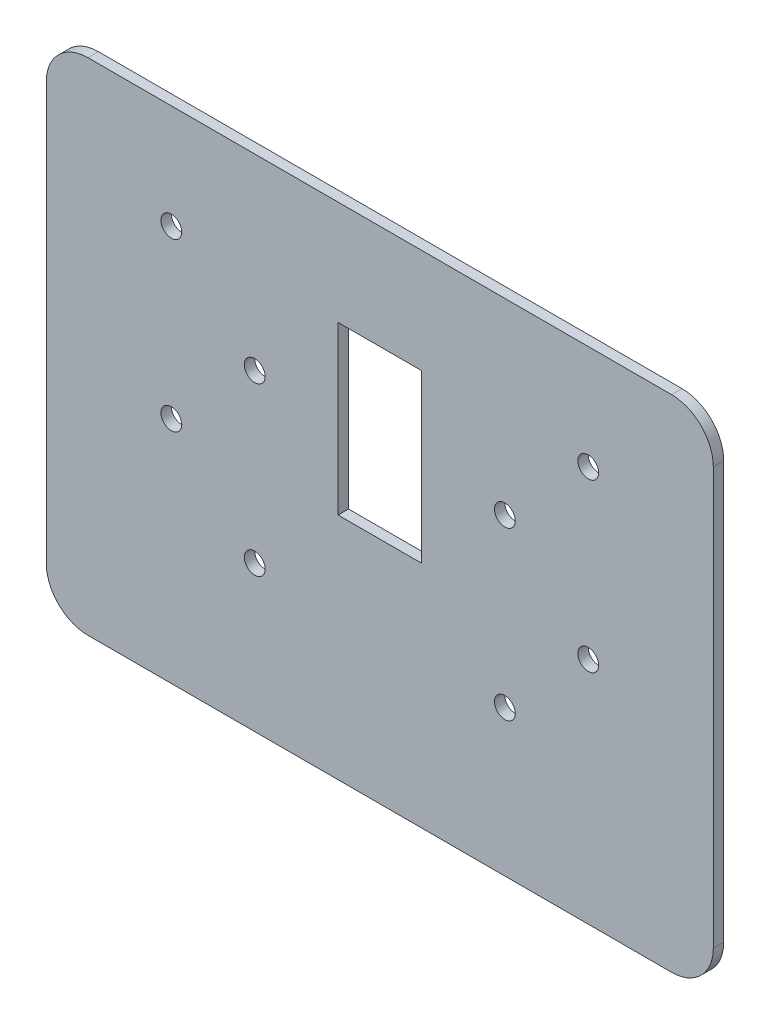
ISO-10303-21;
HEADER;
FILE_DESCRIPTION(('STEP AP214'),'2;1');
FILE_NAME('part.step','',(''),(''),'','','');
FILE_SCHEMA(('AUTOMOTIVE_DESIGN { 1 0 10303 214 1 1 1 1 }'));
ENDSEC;
DATA;
#1=APPLICATION_CONTEXT('core data for automotive mechanical design processes');
#2=APPLICATION_PROTOCOL_DEFINITION('international standard','automotive_design',2000,#1);
#3=PRODUCT_CONTEXT('',#1,'mechanical');
#4=PRODUCT('Part','Part','',(#3));
#5=PRODUCT_RELATED_PRODUCT_CATEGORY('part','',(#4));
#6=PRODUCT_DEFINITION_FORMATION('','',#4);
#7=PRODUCT_DEFINITION_CONTEXT('part definition',#1,'design');
#8=PRODUCT_DEFINITION('design','',#6,#7);
#9=PRODUCT_DEFINITION_SHAPE('','',#8);
#10=(LENGTH_UNIT() NAMED_UNIT(*) SI_UNIT(.MILLI.,.METRE.));
#11=(NAMED_UNIT(*) PLANE_ANGLE_UNIT() SI_UNIT($,.RADIAN.));
#12=(NAMED_UNIT(*) SI_UNIT($,.STERADIAN.) SOLID_ANGLE_UNIT());
#13=UNCERTAINTY_MEASURE_WITH_UNIT(LENGTH_MEASURE(1.E-05),#10,'distance_accuracy_value','');
#14=(GEOMETRIC_REPRESENTATION_CONTEXT(3) GLOBAL_UNCERTAINTY_ASSIGNED_CONTEXT((#13)) GLOBAL_UNIT_ASSIGNED_CONTEXT((#10,
#11,#12)) REPRESENTATION_CONTEXT('',''));
#15=CARTESIAN_POINT('',(0.,0.,0.));
#16=DIRECTION('',(0.,0.,1.));
#17=DIRECTION('',(1.,0.,0.));
#18=AXIS2_PLACEMENT_3D('',#15,#16,#17);
#19=CARTESIAN_POINT('',(0.,463.520831077741,3.175));
#20=DIRECTION('',(0.,1.,0.));
#21=DIRECTION('',(0.,0.,1.));
#22=AXIS2_PLACEMENT_3D('',#19,#20,#21);
#23=PLANE('',#22);
#24=DIRECTION('',(1.,0.,0.));
#25=VECTOR('',#24,1.);
#26=CARTESIAN_POINT('',(0.,463.520831077741,0.));
#27=LINE('',#26,#25);
#28=CARTESIAN_POINT('',(-392.019369125756,463.520831077741,0.));
#29=VERTEX_POINT('',#28);
#30=CARTESIAN_POINT('',(-214.219369125757,463.520831077741,0.));
#31=VERTEX_POINT('',#30);
#32=EDGE_CURVE('E194',#29,#31,#27,.T.);
#33=ORIENTED_EDGE('',*,*,#32,.F.);
#34=DIRECTION('',(0.,0.,-1.));
#35=VECTOR('',#34,1.);
#36=CARTESIAN_POINT('',(-392.019369125756,463.520831077741,3.175));
#37=LINE('',#36,#35);
#38=CARTESIAN_POINT('',(-392.019369125756,463.520831077741,3.175));
#39=VERTEX_POINT('',#38);
#40=EDGE_CURVE('E11',#39,#29,#37,.T.);
#41=ORIENTED_EDGE('',*,*,#40,.F.);
#42=DIRECTION('',(1.,0.,0.));
#43=VECTOR('',#42,1.);
#44=CARTESIAN_POINT('',(0.,463.520831077741,3.175));
#45=LINE('',#44,#43);
#46=CARTESIAN_POINT('',(-214.219369125757,463.520831077741,3.175));
#47=VERTEX_POINT('',#46);
#48=EDGE_CURVE('E276',#39,#47,#45,.T.);
#49=ORIENTED_EDGE('',*,*,#48,.T.);
#50=DIRECTION('',(0.,0.,-1.));
#51=VECTOR('',#50,1.);
#52=CARTESIAN_POINT('',(-214.219369125757,463.520831077741,3.175));
#53=LINE('',#52,#51);
#54=EDGE_CURVE('E55',#47,#31,#53,.T.);
#55=ORIENTED_EDGE('',*,*,#54,.T.);
#56=EDGE_LOOP('',(#33,#41,#49,#55));
#57=FACE_BOUND('',#56,.T.);
#58=ADVANCED_FACE('F36',(#57),#23,.T.);
#59=CARTESIAN_POINT('',(-392.019369125756,450.820831077741,3.175));
#60=DIRECTION('',(0.,0.,-1.));
#61=DIRECTION('',(-1.,0.,0.));
#62=AXIS2_PLACEMENT_3D('',#59,#60,#61);
#63=CYLINDRICAL_SURFACE('',#62,12.7);
#64=CARTESIAN_POINT('',(-392.019369125756,450.820831077741,0.));
#65=DIRECTION('',(0.,0.,1.));
#66=DIRECTION('',(1.,0.,0.));
#67=AXIS2_PLACEMENT_3D('',#64,#65,#66);
#68=CIRCLE('',#67,12.7);
#69=CARTESIAN_POINT('',(-404.719369125757,450.820831077741,0.));
#70=VERTEX_POINT('',#69);
#71=EDGE_CURVE('E196',#29,#70,#68,.T.);
#72=ORIENTED_EDGE('',*,*,#71,.T.);
#73=DIRECTION('',(0.,0.,-1.));
#74=VECTOR('',#73,1.);
#75=CARTESIAN_POINT('',(-404.719369125757,450.820831077741,3.175));
#76=LINE('',#75,#74);
#77=CARTESIAN_POINT('',(-404.719369125757,450.820831077741,3.175));
#78=VERTEX_POINT('',#77);
#79=EDGE_CURVE('E46',#78,#70,#76,.T.);
#80=ORIENTED_EDGE('',*,*,#79,.F.);
#81=CARTESIAN_POINT('',(-392.019369125756,450.820831077741,3.175));
#82=DIRECTION('',(0.,0.,1.));
#83=DIRECTION('',(1.,0.,0.));
#84=AXIS2_PLACEMENT_3D('',#81,#82,#83);
#85=CIRCLE('',#84,12.7);
#86=EDGE_CURVE('E278',#39,#78,#85,.T.);
#87=ORIENTED_EDGE('',*,*,#86,.F.);
#88=ORIENTED_EDGE('',*,*,#40,.T.);
#89=EDGE_LOOP('',(#72,#80,#87,#88));
#90=FACE_BOUND('',#89,.T.);
#91=ADVANCED_FACE('F307',(#90),#63,.T.);
#92=CARTESIAN_POINT('',(-404.719369125756,-3.53802174893844E-13,3.175));
#93=DIRECTION('',(1.,0.,0.));
#94=DIRECTION('',(0.,1.,0.));
#95=AXIS2_PLACEMENT_3D('',#92,#93,#94);
#96=PLANE('',#95);
#97=DIRECTION('',(0.,-1.,0.));
#98=VECTOR('',#97,1.);
#99=CARTESIAN_POINT('',(-404.719369125756,-3.53802174893844E-13,0.));
#100=LINE('',#99,#98);
#101=CARTESIAN_POINT('',(-404.719369125756,323.820831077741,0.));
#102=VERTEX_POINT('',#101);
#103=EDGE_CURVE('E199',#70,#102,#100,.T.);
#104=ORIENTED_EDGE('',*,*,#103,.T.);
#105=DIRECTION('',(0.,0.,-1.));
#106=VECTOR('',#105,1.);
#107=CARTESIAN_POINT('',(-404.719369125756,323.820831077741,3.175));
#108=LINE('',#107,#106);
#109=CARTESIAN_POINT('',(-404.719369125756,323.820831077741,3.175));
#110=VERTEX_POINT('',#109);
#111=EDGE_CURVE('E221',#110,#102,#108,.T.);
#112=ORIENTED_EDGE('',*,*,#111,.F.);
#113=DIRECTION('',(0.,-1.,0.));
#114=VECTOR('',#113,1.);
#115=CARTESIAN_POINT('',(-404.719369125756,-3.53802174893844E-13,3.175));
#116=LINE('',#115,#114);
#117=EDGE_CURVE('E281',#78,#110,#116,.T.);
#118=ORIENTED_EDGE('',*,*,#117,.F.);
#119=ORIENTED_EDGE('',*,*,#79,.T.);
#120=EDGE_LOOP('',(#104,#112,#118,#119));
#121=FACE_BOUND('',#120,.T.);
#122=ADVANCED_FACE('F312',(#121),#96,.F.);
#123=CARTESIAN_POINT('',(-392.019369125756,323.820831077741,3.175));
#124=DIRECTION('',(0.,0.,-1.));
#125=DIRECTION('',(-1.,0.,0.));
#126=AXIS2_PLACEMENT_3D('',#123,#124,#125);
#127=CYLINDRICAL_SURFACE('',#126,12.7);
#128=CARTESIAN_POINT('',(-392.019369125756,323.820831077741,0.));
#129=DIRECTION('',(0.,0.,1.));
#130=DIRECTION('',(1.,0.,0.));
#131=AXIS2_PLACEMENT_3D('',#128,#129,#130);
#132=CIRCLE('',#131,12.7);
#133=CARTESIAN_POINT('',(-392.019369125756,311.120831077741,0.));
#134=VERTEX_POINT('',#133);
#135=EDGE_CURVE('E202',#102,#134,#132,.T.);
#136=ORIENTED_EDGE('',*,*,#135,.T.);
#137=DIRECTION('',(0.,0.,-1.));
#138=VECTOR('',#137,1.);
#139=CARTESIAN_POINT('',(-392.019369125756,311.120831077741,3.175));
#140=LINE('',#139,#138);
#141=CARTESIAN_POINT('',(-392.019369125756,311.120831077741,3.175));
#142=VERTEX_POINT('',#141);
#143=EDGE_CURVE('E218',#142,#134,#140,.T.);
#144=ORIENTED_EDGE('',*,*,#143,.F.);
#145=CARTESIAN_POINT('',(-392.019369125756,323.820831077741,3.175));
#146=DIRECTION('',(0.,0.,1.));
#147=DIRECTION('',(1.,0.,0.));
#148=AXIS2_PLACEMENT_3D('',#145,#146,#147);
#149=CIRCLE('',#148,12.7);
#150=EDGE_CURVE('E284',#110,#142,#149,.T.);
#151=ORIENTED_EDGE('',*,*,#150,.F.);
#152=ORIENTED_EDGE('',*,*,#111,.T.);
#153=EDGE_LOOP('',(#136,#144,#151,#152));
#154=FACE_BOUND('',#153,.T.);
#155=ADVANCED_FACE('F288',(#154),#127,.T.);
#156=CARTESIAN_POINT('',(0.,311.120831077741,3.175));
#157=DIRECTION('',(0.,1.,0.));
#158=DIRECTION('',(0.,0.,1.));
#159=AXIS2_PLACEMENT_3D('',#156,#157,#158);
#160=PLANE('',#159);
#161=DIRECTION('',(1.,0.,0.));
#162=VECTOR('',#161,1.);
#163=CARTESIAN_POINT('',(0.,311.120831077741,0.));
#164=LINE('',#163,#162);
#165=CARTESIAN_POINT('',(-214.219369125757,311.120831077741,0.));
#166=VERTEX_POINT('',#165);
#167=EDGE_CURVE('E205',#134,#166,#164,.T.);
#168=ORIENTED_EDGE('',*,*,#167,.T.);
#169=DIRECTION('',(0.,0.,-1.));
#170=VECTOR('',#169,1.);
#171=CARTESIAN_POINT('',(-214.219369125757,311.120831077741,3.175));
#172=LINE('',#171,#170);
#173=CARTESIAN_POINT('',(-214.219369125757,311.120831077741,3.175));
#174=VERTEX_POINT('',#173);
#175=EDGE_CURVE('E152',#174,#166,#172,.T.);
#176=ORIENTED_EDGE('',*,*,#175,.F.);
#177=DIRECTION('',(1.,0.,0.));
#178=VECTOR('',#177,1.);
#179=CARTESIAN_POINT('',(0.,311.120831077741,3.175));
#180=LINE('',#179,#178);
#181=EDGE_CURVE('E141',#142,#174,#180,.T.);
#182=ORIENTED_EDGE('',*,*,#181,.F.);
#183=ORIENTED_EDGE('',*,*,#143,.T.);
#184=EDGE_LOOP('',(#168,#176,#182,#183));
#185=FACE_BOUND('',#184,.T.);
#186=ADVANCED_FACE('F290',(#185),#160,.F.);
#187=CARTESIAN_POINT('',(-214.219369125757,323.820831077741,3.175));
#188=DIRECTION('',(0.,0.,-1.));
#189=DIRECTION('',(-1.,0.,0.));
#190=AXIS2_PLACEMENT_3D('',#187,#188,#189);
#191=CYLINDRICAL_SURFACE('',#190,12.7);
#192=CARTESIAN_POINT('',(-214.219369125757,323.820831077741,0.));
#193=DIRECTION('',(0.,0.,1.));
#194=DIRECTION('',(1.,0.,0.));
#195=AXIS2_PLACEMENT_3D('',#192,#193,#194);
#196=CIRCLE('',#195,12.7);
#197=CARTESIAN_POINT('',(-201.519369125757,323.820831077741,0.));
#198=VERTEX_POINT('',#197);
#199=EDGE_CURVE('E149',#166,#198,#196,.T.);
#200=ORIENTED_EDGE('',*,*,#199,.T.);
#201=DIRECTION('',(0.,0.,-1.));
#202=VECTOR('',#201,1.);
#203=CARTESIAN_POINT('',(-201.519369125757,323.820831077741,3.175));
#204=LINE('',#203,#202);
#205=CARTESIAN_POINT('',(-201.519369125757,323.820831077741,3.175));
#206=VERTEX_POINT('',#205);
#207=EDGE_CURVE('E147',#206,#198,#204,.T.);
#208=ORIENTED_EDGE('',*,*,#207,.F.);
#209=CARTESIAN_POINT('',(-214.219369125757,323.820831077741,3.175));
#210=DIRECTION('',(0.,0.,1.));
#211=DIRECTION('',(1.,0.,0.));
#212=AXIS2_PLACEMENT_3D('',#209,#210,#211);
#213=CIRCLE('',#212,12.7);
#214=EDGE_CURVE('E133',#174,#206,#213,.T.);
#215=ORIENTED_EDGE('',*,*,#214,.F.);
#216=ORIENTED_EDGE('',*,*,#175,.T.);
#217=EDGE_LOOP('',(#200,#208,#215,#216));
#218=FACE_BOUND('',#217,.T.);
#219=ADVANCED_FACE('F148',(#218),#191,.T.);
#220=CARTESIAN_POINT('',(-201.519369125757,0.,3.175));
#221=DIRECTION('',(1.,0.,0.));
#222=DIRECTION('',(0.,1.,0.));
#223=AXIS2_PLACEMENT_3D('',#220,#221,#222);
#224=PLANE('',#223);
#225=DIRECTION('',(0.,-1.,0.));
#226=VECTOR('',#225,1.);
#227=CARTESIAN_POINT('',(-201.519369125757,0.,0.));
#228=LINE('',#227,#226);
#229=CARTESIAN_POINT('',(-201.519369125757,450.820831077741,0.));
#230=VERTEX_POINT('',#229);
#231=EDGE_CURVE('E209',#230,#198,#228,.T.);
#232=ORIENTED_EDGE('',*,*,#231,.F.);
#233=DIRECTION('',(0.,0.,-1.));
#234=VECTOR('',#233,1.);
#235=CARTESIAN_POINT('',(-201.519369125757,450.820831077741,3.175));
#236=LINE('',#235,#234);
#237=CARTESIAN_POINT('',(-201.519369125757,450.820831077741,3.175));
#238=VERTEX_POINT('',#237);
#239=EDGE_CURVE('E92',#238,#230,#236,.T.);
#240=ORIENTED_EDGE('',*,*,#239,.F.);
#241=DIRECTION('',(0.,-1.,0.));
#242=VECTOR('',#241,1.);
#243=CARTESIAN_POINT('',(-201.519369125757,0.,3.175));
#244=LINE('',#243,#242);
#245=EDGE_CURVE('E139',#238,#206,#244,.T.);
#246=ORIENTED_EDGE('',*,*,#245,.T.);
#247=ORIENTED_EDGE('',*,*,#207,.T.);
#248=EDGE_LOOP('',(#232,#240,#246,#247));
#249=FACE_BOUND('',#248,.T.);
#250=ADVANCED_FACE('F154',(#249),#224,.T.);
#251=CARTESIAN_POINT('',(0.,380.970831077741,3.175));
#252=DIRECTION('',(0.,-1.,0.));
#253=DIRECTION('',(0.,0.,-1.));
#254=AXIS2_PLACEMENT_3D('',#251,#252,#253);
#255=PLANE('',#254);
#256=DIRECTION('',(-1.,0.,0.));
#257=VECTOR('',#256,1.);
#258=CARTESIAN_POINT('',(0.,380.970831077741,0.));
#259=LINE('',#258,#257);
#260=CARTESIAN_POINT('',(-290.419369125757,380.970831077741,0.));
#261=VERTEX_POINT('',#260);
#262=CARTESIAN_POINT('',(-315.819369125757,380.970831077741,0.));
#263=VERTEX_POINT('',#262);
#264=EDGE_CURVE('E167',#261,#263,#259,.T.);
#265=ORIENTED_EDGE('',*,*,#264,.T.);
#266=DIRECTION('',(0.,0.,-1.));
#267=VECTOR('',#266,1.);
#268=CARTESIAN_POINT('',(-315.819369125757,380.970831077741,3.175));
#269=LINE('',#268,#267);
#270=CARTESIAN_POINT('',(-315.819369125757,380.970831077741,3.175));
#271=VERTEX_POINT('',#270);
#272=EDGE_CURVE('E40',#271,#263,#269,.T.);
#273=ORIENTED_EDGE('',*,*,#272,.F.);
#274=DIRECTION('',(-1.,0.,0.));
#275=VECTOR('',#274,1.);
#276=CARTESIAN_POINT('',(0.,380.970831077741,3.175));
#277=LINE('',#276,#275);
#278=CARTESIAN_POINT('',(-290.419369125757,380.970831077741,3.175));
#279=VERTEX_POINT('',#278);
#280=EDGE_CURVE('E500',#279,#271,#277,.T.);
#281=ORIENTED_EDGE('',*,*,#280,.F.);
#282=DIRECTION('',(0.,0.,-1.));
#283=VECTOR('',#282,1.);
#284=CARTESIAN_POINT('',(-290.419369125757,380.970831077741,3.175));
#285=LINE('',#284,#283);
#286=EDGE_CURVE('E157',#279,#261,#285,.T.);
#287=ORIENTED_EDGE('',*,*,#286,.T.);
#288=EDGE_LOOP('',(#265,#273,#281,#287));
#289=FACE_BOUND('',#288,.T.);
#290=ADVANCED_FACE('F240',(#289),#255,.F.);
#291=CARTESIAN_POINT('',(-315.819369125757,0.,3.175));
#292=DIRECTION('',(-1.,0.,0.));
#293=DIRECTION('',(0.,0.,1.));
#294=AXIS2_PLACEMENT_3D('',#291,#292,#293);
#295=PLANE('',#294);
#296=DIRECTION('',(0.,1.,0.));
#297=VECTOR('',#296,1.);
#298=CARTESIAN_POINT('',(-315.819369125757,0.,0.));
#299=LINE('',#298,#297);
#300=CARTESIAN_POINT('',(-315.819369125757,431.770831077741,0.));
#301=VERTEX_POINT('',#300);
#302=EDGE_CURVE('E170',#263,#301,#299,.T.);
#303=ORIENTED_EDGE('',*,*,#302,.T.);
#304=DIRECTION('',(0.,0.,-1.));
#305=VECTOR('',#304,1.);
#306=CARTESIAN_POINT('',(-315.819369125757,431.770831077741,3.175));
#307=LINE('',#306,#305);
#308=CARTESIAN_POINT('',(-315.819369125757,431.770831077741,3.175));
#309=VERTEX_POINT('',#308);
#310=EDGE_CURVE('E230',#309,#301,#307,.T.);
#311=ORIENTED_EDGE('',*,*,#310,.F.);
#312=DIRECTION('',(0.,1.,0.));
#313=VECTOR('',#312,1.);
#314=CARTESIAN_POINT('',(-315.819369125757,0.,3.175));
#315=LINE('',#314,#313);
#316=EDGE_CURVE('E105',#271,#309,#315,.T.);
#317=ORIENTED_EDGE('',*,*,#316,.F.);
#318=ORIENTED_EDGE('',*,*,#272,.T.);
#319=EDGE_LOOP('',(#303,#311,#317,#318));
#320=FACE_BOUND('',#319,.T.);
#321=ADVANCED_FACE('F236',(#320),#295,.F.);
#322=CARTESIAN_POINT('',(0.,431.770831077741,3.175));
#323=DIRECTION('',(0.,1.,0.));
#324=DIRECTION('',(0.,0.,1.));
#325=AXIS2_PLACEMENT_3D('',#322,#323,#324);
#326=PLANE('',#325);
#327=DIRECTION('',(1.,0.,0.));
#328=VECTOR('',#327,1.);
#329=CARTESIAN_POINT('',(0.,431.770831077741,0.));
#330=LINE('',#329,#328);
#331=CARTESIAN_POINT('',(-290.419369125757,431.770831077741,0.));
#332=VERTEX_POINT('',#331);
#333=EDGE_CURVE('E172',#301,#332,#330,.T.);
#334=ORIENTED_EDGE('',*,*,#333,.T.);
#335=DIRECTION('',(0.,0.,-1.));
#336=VECTOR('',#335,1.);
#337=CARTESIAN_POINT('',(-290.419369125757,431.770831077741,3.175));
#338=LINE('',#337,#336);
#339=CARTESIAN_POINT('',(-290.419369125757,431.770831077741,3.175));
#340=VERTEX_POINT('',#339);
#341=EDGE_CURVE('E228',#340,#332,#338,.T.);
#342=ORIENTED_EDGE('',*,*,#341,.F.);
#343=DIRECTION('',(1.,0.,0.));
#344=VECTOR('',#343,1.);
#345=CARTESIAN_POINT('',(0.,431.770831077741,3.175));
#346=LINE('',#345,#344);
#347=EDGE_CURVE('E254',#309,#340,#346,.T.);
#348=ORIENTED_EDGE('',*,*,#347,.F.);
#349=ORIENTED_EDGE('',*,*,#310,.T.);
#350=EDGE_LOOP('',(#334,#342,#348,#349));
#351=FACE_BOUND('',#350,.T.);
#352=ADVANCED_FACE('F247',(#351),#326,.F.);
#353=CARTESIAN_POINT('',(-366.619369125757,431.770831077741,3.175));
#354=DIRECTION('',(0.,0.,-1.));
#355=DIRECTION('',(-1.,0.,0.));
#356=AXIS2_PLACEMENT_3D('',#353,#354,#355);
#357=CYLINDRICAL_SURFACE('',#356,3.17499999999997);
#358=CARTESIAN_POINT('',(-366.619369125757,431.770831077741,3.175));
#359=DIRECTION('',(0.,0.,1.));
#360=DIRECTION('',(1.,0.,0.));
#361=AXIS2_PLACEMENT_3D('',#358,#359,#360);
#362=CIRCLE('',#361,3.17499999999997);
#363=CARTESIAN_POINT('',(-363.444369125757,431.770831077741,3.175));
#364=VERTEX_POINT('',#363);
#365=EDGE_CURVE('E273',#364,#364,#362,.T.);
#366=ORIENTED_EDGE('',*,*,#365,.T.);
#367=EDGE_LOOP('',(#366));
#368=FACE_BOUND('',#367,.T.);
#369=CARTESIAN_POINT('',(-366.619369125757,431.770831077741,0.));
#370=DIRECTION('',(0.,0.,1.));
#371=DIRECTION('',(1.,0.,0.));
#372=AXIS2_PLACEMENT_3D('',#369,#370,#371);
#373=CIRCLE('',#372,3.17499999999997);
#374=CARTESIAN_POINT('',(-363.444369125757,431.770831077741,0.));
#375=VERTEX_POINT('',#374);
#376=EDGE_CURVE('E191',#375,#375,#373,.T.);
#377=ORIENTED_EDGE('',*,*,#376,.F.);
#378=EDGE_LOOP('',(#377));
#379=FACE_BOUND('',#378,.T.);
#380=ADVANCED_FACE('F317',(#368,#379),#357,.F.);
#381=CARTESIAN_POINT('',(-341.219369125757,406.37083107774,3.175));
#382=DIRECTION('',(0.,0.,-1.));
#383=DIRECTION('',(-1.,0.,0.));
#384=AXIS2_PLACEMENT_3D('',#381,#382,#383);
#385=CYLINDRICAL_SURFACE('',#384,3.17499999999997);
#386=CARTESIAN_POINT('',(-341.219369125757,406.37083107774,3.175));
#387=DIRECTION('',(0.,0.,1.));
#388=DIRECTION('',(1.,0.,0.));
#389=AXIS2_PLACEMENT_3D('',#386,#387,#388);
#390=CIRCLE('',#389,3.17499999999997);
#391=CARTESIAN_POINT('',(-338.044369125757,406.37083107774,3.175));
#392=VERTEX_POINT('',#391);
#393=EDGE_CURVE('E270',#392,#392,#390,.T.);
#394=ORIENTED_EDGE('',*,*,#393,.T.);
#395=EDGE_LOOP('',(#394));
#396=FACE_BOUND('',#395,.T.);
#397=CARTESIAN_POINT('',(-341.219369125757,406.37083107774,0.));
#398=DIRECTION('',(0.,0.,1.));
#399=DIRECTION('',(1.,0.,0.));
#400=AXIS2_PLACEMENT_3D('',#397,#398,#399);
#401=CIRCLE('',#400,3.17499999999997);
#402=CARTESIAN_POINT('',(-338.044369125757,406.37083107774,0.));
#403=VERTEX_POINT('',#402);
#404=EDGE_CURVE('E188',#403,#403,#401,.T.);
#405=ORIENTED_EDGE('',*,*,#404,.F.);
#406=EDGE_LOOP('',(#405));
#407=FACE_BOUND('',#406,.T.);
#408=ADVANCED_FACE('F320',(#396,#407),#385,.F.);
#409=CARTESIAN_POINT('',(-366.619369125757,380.970831077741,3.175));
#410=DIRECTION('',(0.,0.,-1.));
#411=DIRECTION('',(-1.,0.,0.));
#412=AXIS2_PLACEMENT_3D('',#409,#410,#411);
#413=CYLINDRICAL_SURFACE('',#412,3.17499999999997);
#414=CARTESIAN_POINT('',(-366.619369125757,380.970831077741,3.175));
#415=DIRECTION('',(0.,0.,1.));
#416=DIRECTION('',(1.,0.,0.));
#417=AXIS2_PLACEMENT_3D('',#414,#415,#416);
#418=CIRCLE('',#417,3.17499999999997);
#419=CARTESIAN_POINT('',(-363.444369125757,380.970831077741,3.175));
#420=VERTEX_POINT('',#419);
#421=EDGE_CURVE('E267',#420,#420,#418,.T.);
#422=ORIENTED_EDGE('',*,*,#421,.T.);
#423=EDGE_LOOP('',(#422));
#424=FACE_BOUND('',#423,.T.);
#425=CARTESIAN_POINT('',(-366.619369125757,380.970831077741,0.));
#426=DIRECTION('',(0.,0.,1.));
#427=DIRECTION('',(1.,0.,0.));
#428=AXIS2_PLACEMENT_3D('',#425,#426,#427);
#429=CIRCLE('',#428,3.17499999999997);
#430=CARTESIAN_POINT('',(-363.444369125757,380.970831077741,0.));
#431=VERTEX_POINT('',#430);
#432=EDGE_CURVE('E185',#431,#431,#429,.T.);
#433=ORIENTED_EDGE('',*,*,#432,.F.);
#434=EDGE_LOOP('',(#433));
#435=FACE_BOUND('',#434,.T.);
#436=ADVANCED_FACE('F324',(#424,#435),#413,.F.);
#437=CARTESIAN_POINT('',(-265.019369125756,406.370831077741,3.175));
#438=DIRECTION('',(0.,0.,-1.));
#439=DIRECTION('',(-1.,0.,0.));
#440=AXIS2_PLACEMENT_3D('',#437,#438,#439);
#441=CYLINDRICAL_SURFACE('',#440,3.17499999999997);
#442=CARTESIAN_POINT('',(-265.019369125756,406.370831077741,3.175));
#443=DIRECTION('',(0.,0.,1.));
#444=DIRECTION('',(1.,0.,0.));
#445=AXIS2_PLACEMENT_3D('',#442,#443,#444);
#446=CIRCLE('',#445,3.17499999999997);
#447=CARTESIAN_POINT('',(-261.844369125757,406.370831077741,3.175));
#448=VERTEX_POINT('',#447);
#449=EDGE_CURVE('E264',#448,#448,#446,.T.);
#450=ORIENTED_EDGE('',*,*,#449,.T.);
#451=EDGE_LOOP('',(#450));
#452=FACE_BOUND('',#451,.T.);
#453=CARTESIAN_POINT('',(-265.019369125756,406.370831077741,0.));
#454=DIRECTION('',(0.,0.,1.));
#455=DIRECTION('',(1.,0.,0.));
#456=AXIS2_PLACEMENT_3D('',#453,#454,#455);
#457=CIRCLE('',#456,3.17499999999997);
#458=CARTESIAN_POINT('',(-261.844369125757,406.370831077741,0.));
#459=VERTEX_POINT('',#458);
#460=EDGE_CURVE('E182',#459,#459,#457,.T.);
#461=ORIENTED_EDGE('',*,*,#460,.F.);
#462=EDGE_LOOP('',(#461));
#463=FACE_BOUND('',#462,.T.);
#464=ADVANCED_FACE('F328',(#452,#463),#441,.F.);
#465=CARTESIAN_POINT('',(-239.619369125757,380.970831077741,3.175));
#466=DIRECTION('',(0.,0.,-1.));
#467=DIRECTION('',(-1.,0.,0.));
#468=AXIS2_PLACEMENT_3D('',#465,#466,#467);
#469=CYLINDRICAL_SURFACE('',#468,3.175);
#470=CARTESIAN_POINT('',(-239.619369125757,380.970831077741,3.175));
#471=DIRECTION('',(0.,0.,1.));
#472=DIRECTION('',(1.,0.,0.));
#473=AXIS2_PLACEMENT_3D('',#470,#471,#472);
#474=CIRCLE('',#473,3.175);
#475=CARTESIAN_POINT('',(-236.444369125757,380.970831077741,3.175));
#476=VERTEX_POINT('',#475);
#477=EDGE_CURVE('E257',#476,#476,#474,.T.);
#478=ORIENTED_EDGE('',*,*,#477,.T.);
#479=EDGE_LOOP('',(#478));
#480=FACE_BOUND('',#479,.T.);
#481=CARTESIAN_POINT('',(-239.619369125757,380.970831077741,0.));
#482=DIRECTION('',(0.,0.,1.));
#483=DIRECTION('',(1.,0.,0.));
#484=AXIS2_PLACEMENT_3D('',#481,#482,#483);
#485=CIRCLE('',#484,3.175);
#486=CARTESIAN_POINT('',(-236.444369125757,380.970831077741,0.));
#487=VERTEX_POINT('',#486);
#488=EDGE_CURVE('E179',#487,#487,#485,.T.);
#489=ORIENTED_EDGE('',*,*,#488,.F.);
#490=EDGE_LOOP('',(#489));
#491=FACE_BOUND('',#490,.T.);
#492=ADVANCED_FACE('F332',(#480,#491),#469,.F.);
#493=CARTESIAN_POINT('',(-239.619369125757,431.770831077741,3.175));
#494=DIRECTION('',(0.,0.,-1.));
#495=DIRECTION('',(-1.,0.,0.));
#496=AXIS2_PLACEMENT_3D('',#493,#494,#495);
#497=CYLINDRICAL_SURFACE('',#496,3.17499999999997);
#498=CARTESIAN_POINT('',(-239.619369125757,431.770831077741,3.175));
#499=DIRECTION('',(0.,0.,1.));
#500=DIRECTION('',(1.,0.,0.));
#501=AXIS2_PLACEMENT_3D('',#498,#499,#500);
#502=CIRCLE('',#501,3.17499999999997);
#503=CARTESIAN_POINT('',(-236.444369125757,431.770831077741,3.175));
#504=VERTEX_POINT('',#503);
#505=EDGE_CURVE('E253',#504,#504,#502,.T.);
#506=ORIENTED_EDGE('',*,*,#505,.T.);
#507=EDGE_LOOP('',(#506));
#508=FACE_BOUND('',#507,.T.);
#509=CARTESIAN_POINT('',(-239.619369125757,431.770831077741,0.));
#510=DIRECTION('',(0.,0.,1.));
#511=DIRECTION('',(1.,0.,0.));
#512=AXIS2_PLACEMENT_3D('',#509,#510,#511);
#513=CIRCLE('',#512,3.17499999999997);
#514=CARTESIAN_POINT('',(-236.444369125757,431.770831077741,0.));
#515=VERTEX_POINT('',#514);
#516=EDGE_CURVE('E176',#515,#515,#513,.T.);
#517=ORIENTED_EDGE('',*,*,#516,.F.);
#518=EDGE_LOOP('',(#517));
#519=FACE_BOUND('',#518,.T.);
#520=ADVANCED_FACE('F336',(#508,#519),#497,.F.);
#521=CARTESIAN_POINT('',(-290.419369125757,0.,3.175));
#522=DIRECTION('',(1.,0.,0.));
#523=DIRECTION('',(0.,0.,-1.));
#524=AXIS2_PLACEMENT_3D('',#521,#522,#523);
#525=PLANE('',#524);
#526=DIRECTION('',(0.,-1.,0.));
#527=VECTOR('',#526,1.);
#528=CARTESIAN_POINT('',(-290.419369125757,0.,0.));
#529=LINE('',#528,#527);
#530=EDGE_CURVE('E174',#332,#261,#529,.T.);
#531=ORIENTED_EDGE('',*,*,#530,.T.);
#532=ORIENTED_EDGE('',*,*,#286,.F.);
#533=DIRECTION('',(0.,-1.,0.));
#534=VECTOR('',#533,1.);
#535=CARTESIAN_POINT('',(-290.419369125757,0.,3.175));
#536=LINE('',#535,#534);
#537=EDGE_CURVE('E251',#340,#279,#536,.T.);
#538=ORIENTED_EDGE('',*,*,#537,.F.);
#539=ORIENTED_EDGE('',*,*,#341,.T.);
#540=EDGE_LOOP('',(#531,#532,#538,#539));
#541=FACE_BOUND('',#540,.T.);
#542=ADVANCED_FACE('F250',(#541),#525,.F.);
#543=CARTESIAN_POINT('',(-265.019369125757,355.570831077741,3.175));
#544=DIRECTION('',(0.,0.,-1.));
#545=DIRECTION('',(-1.,0.,0.));
#546=AXIS2_PLACEMENT_3D('',#543,#544,#545);
#547=CYLINDRICAL_SURFACE('',#546,3.17500000000002);
#548=CARTESIAN_POINT('',(-265.019369125757,355.570831077741,3.175));
#549=DIRECTION('',(0.,0.,1.));
#550=DIRECTION('',(1.,0.,0.));
#551=AXIS2_PLACEMENT_3D('',#548,#549,#550);
#552=CIRCLE('',#551,3.17500000000002);
#553=CARTESIAN_POINT('',(-261.844369125757,355.570831077741,3.175));
#554=VERTEX_POINT('',#553);
#555=EDGE_CURVE('E355',#554,#554,#552,.T.);
#556=ORIENTED_EDGE('',*,*,#555,.T.);
#557=EDGE_LOOP('',(#556));
#558=FACE_BOUND('',#557,.T.);
#559=CARTESIAN_POINT('',(-265.019369125757,355.570831077741,0.));
#560=DIRECTION('',(0.,0.,1.));
#561=DIRECTION('',(1.,0.,0.));
#562=AXIS2_PLACEMENT_3D('',#559,#560,#561);
#563=CIRCLE('',#562,3.17500000000002);
#564=CARTESIAN_POINT('',(-261.844369125757,355.570831077741,0.));
#565=VERTEX_POINT('',#564);
#566=EDGE_CURVE('E164',#565,#565,#563,.T.);
#567=ORIENTED_EDGE('',*,*,#566,.F.);
#568=EDGE_LOOP('',(#567));
#569=FACE_BOUND('',#568,.T.);
#570=ADVANCED_FACE('F302',(#558,#569),#547,.F.);
#571=CARTESIAN_POINT('',(-341.219369125756,355.57083107774,3.175));
#572=DIRECTION('',(0.,0.,-1.));
#573=DIRECTION('',(-1.,0.,0.));
#574=AXIS2_PLACEMENT_3D('',#571,#572,#573);
#575=CYLINDRICAL_SURFACE('',#574,3.17500000000002);
#576=CARTESIAN_POINT('',(-341.219369125756,355.57083107774,3.175));
#577=DIRECTION('',(0.,0.,1.));
#578=DIRECTION('',(1.,0.,0.));
#579=AXIS2_PLACEMENT_3D('',#576,#577,#578);
#580=CIRCLE('',#579,3.17500000000002);
#581=CARTESIAN_POINT('',(-338.044369125756,355.57083107774,3.175));
#582=VERTEX_POINT('',#581);
#583=EDGE_CURVE('E214',#582,#582,#580,.T.);
#584=ORIENTED_EDGE('',*,*,#583,.T.);
#585=EDGE_LOOP('',(#584));
#586=FACE_BOUND('',#585,.T.);
#587=CARTESIAN_POINT('',(-341.219369125756,355.57083107774,0.));
#588=DIRECTION('',(0.,0.,1.));
#589=DIRECTION('',(1.,0.,0.));
#590=AXIS2_PLACEMENT_3D('',#587,#588,#589);
#591=CIRCLE('',#590,3.17500000000002);
#592=CARTESIAN_POINT('',(-338.044369125756,355.57083107774,0.));
#593=VERTEX_POINT('',#592);
#594=EDGE_CURVE('E161',#593,#593,#591,.T.);
#595=ORIENTED_EDGE('',*,*,#594,.F.);
#596=EDGE_LOOP('',(#595));
#597=FACE_BOUND('',#596,.T.);
#598=ADVANCED_FACE('F38',(#586,#597),#575,.F.);
#599=CARTESIAN_POINT('',(-214.219369125757,450.820831077741,3.175));
#600=DIRECTION('',(0.,0.,-1.));
#601=DIRECTION('',(-1.,0.,0.));
#602=AXIS2_PLACEMENT_3D('',#599,#600,#601);
#603=CYLINDRICAL_SURFACE('',#602,12.7);
#604=CARTESIAN_POINT('',(-214.219369125757,450.820831077741,0.));
#605=DIRECTION('',(0.,0.,1.));
#606=DIRECTION('',(1.,0.,0.));
#607=AXIS2_PLACEMENT_3D('',#604,#605,#606);
#608=CIRCLE('',#607,12.7);
#609=EDGE_CURVE('E211',#31,#230,#608,.F.);
#610=ORIENTED_EDGE('',*,*,#609,.F.);
#611=ORIENTED_EDGE('',*,*,#54,.F.);
#612=CARTESIAN_POINT('',(-214.219369125757,450.820831077741,3.175));
#613=DIRECTION('',(0.,0.,1.));
#614=DIRECTION('',(1.,0.,0.));
#615=AXIS2_PLACEMENT_3D('',#612,#613,#614);
#616=CIRCLE('',#615,12.7);
#617=EDGE_CURVE('E155',#47,#238,#616,.F.);
#618=ORIENTED_EDGE('',*,*,#617,.T.);
#619=ORIENTED_EDGE('',*,*,#239,.T.);
#620=EDGE_LOOP('',(#610,#611,#618,#619));
#621=FACE_BOUND('',#620,.T.);
#622=ADVANCED_FACE('F293',(#621),#603,.T.);
#623=CARTESIAN_POINT('',(0.,0.,3.175));
#624=DIRECTION('',(0.,0.,1.));
#625=DIRECTION('',(1.,0.,0.));
#626=AXIS2_PLACEMENT_3D('',#623,#624,#625);
#627=PLANE('',#626);
#628=ORIENTED_EDGE('',*,*,#583,.F.);
#629=EDGE_LOOP('',(#628));
#630=FACE_BOUND('',#629,.T.);
#631=ORIENTED_EDGE('',*,*,#555,.F.);
#632=EDGE_LOOP('',(#631));
#633=FACE_BOUND('',#632,.T.);
#634=ORIENTED_EDGE('',*,*,#280,.T.);
#635=ORIENTED_EDGE('',*,*,#316,.T.);
#636=ORIENTED_EDGE('',*,*,#347,.T.);
#637=ORIENTED_EDGE('',*,*,#537,.T.);
#638=EDGE_LOOP('',(#634,#635,#636,#637));
#639=FACE_BOUND('',#638,.T.);
#640=ORIENTED_EDGE('',*,*,#505,.F.);
#641=EDGE_LOOP('',(#640));
#642=FACE_BOUND('',#641,.T.);
#643=ORIENTED_EDGE('',*,*,#477,.F.);
#644=EDGE_LOOP('',(#643));
#645=FACE_BOUND('',#644,.T.);
#646=ORIENTED_EDGE('',*,*,#449,.F.);
#647=EDGE_LOOP('',(#646));
#648=FACE_BOUND('',#647,.T.);
#649=ORIENTED_EDGE('',*,*,#421,.F.);
#650=EDGE_LOOP('',(#649));
#651=FACE_BOUND('',#650,.T.);
#652=ORIENTED_EDGE('',*,*,#393,.F.);
#653=EDGE_LOOP('',(#652));
#654=FACE_BOUND('',#653,.T.);
#655=ORIENTED_EDGE('',*,*,#365,.F.);
#656=EDGE_LOOP('',(#655));
#657=FACE_BOUND('',#656,.T.);
#658=ORIENTED_EDGE('',*,*,#48,.F.);
#659=ORIENTED_EDGE('',*,*,#86,.T.);
#660=ORIENTED_EDGE('',*,*,#117,.T.);
#661=ORIENTED_EDGE('',*,*,#150,.T.);
#662=ORIENTED_EDGE('',*,*,#181,.T.);
#663=ORIENTED_EDGE('',*,*,#214,.T.);
#664=ORIENTED_EDGE('',*,*,#245,.F.);
#665=ORIENTED_EDGE('',*,*,#617,.F.);
#666=EDGE_LOOP('',(#658,#659,#660,#661,#662,#663,#664,#665));
#667=FACE_BOUND('',#666,.T.);
#668=ADVANCED_FACE('F136',(#630,#633,#639,#642,#645,#648,#651,#654,#657,#667),#627,.T.);
#669=CARTESIAN_POINT('',(0.,0.,0.));
#670=DIRECTION('',(0.,0.,1.));
#671=DIRECTION('',(1.,0.,0.));
#672=AXIS2_PLACEMENT_3D('',#669,#670,#671);
#673=PLANE('',#672);
#674=ORIENTED_EDGE('',*,*,#594,.T.);
#675=EDGE_LOOP('',(#674));
#676=FACE_BOUND('',#675,.T.);
#677=ORIENTED_EDGE('',*,*,#566,.T.);
#678=EDGE_LOOP('',(#677));
#679=FACE_BOUND('',#678,.T.);
#680=ORIENTED_EDGE('',*,*,#264,.F.);
#681=ORIENTED_EDGE('',*,*,#530,.F.);
#682=ORIENTED_EDGE('',*,*,#333,.F.);
#683=ORIENTED_EDGE('',*,*,#302,.F.);
#684=EDGE_LOOP('',(#680,#681,#682,#683));
#685=FACE_BOUND('',#684,.T.);
#686=ORIENTED_EDGE('',*,*,#516,.T.);
#687=EDGE_LOOP('',(#686));
#688=FACE_BOUND('',#687,.T.);
#689=ORIENTED_EDGE('',*,*,#488,.T.);
#690=EDGE_LOOP('',(#689));
#691=FACE_BOUND('',#690,.T.);
#692=ORIENTED_EDGE('',*,*,#460,.T.);
#693=EDGE_LOOP('',(#692));
#694=FACE_BOUND('',#693,.T.);
#695=ORIENTED_EDGE('',*,*,#432,.T.);
#696=EDGE_LOOP('',(#695));
#697=FACE_BOUND('',#696,.T.);
#698=ORIENTED_EDGE('',*,*,#404,.T.);
#699=EDGE_LOOP('',(#698));
#700=FACE_BOUND('',#699,.T.);
#701=ORIENTED_EDGE('',*,*,#376,.T.);
#702=EDGE_LOOP('',(#701));
#703=FACE_BOUND('',#702,.T.);
#704=ORIENTED_EDGE('',*,*,#32,.T.);
#705=ORIENTED_EDGE('',*,*,#609,.T.);
#706=ORIENTED_EDGE('',*,*,#231,.T.);
#707=ORIENTED_EDGE('',*,*,#199,.F.);
#708=ORIENTED_EDGE('',*,*,#167,.F.);
#709=ORIENTED_EDGE('',*,*,#135,.F.);
#710=ORIENTED_EDGE('',*,*,#103,.F.);
#711=ORIENTED_EDGE('',*,*,#71,.F.);
#712=EDGE_LOOP('',(#704,#705,#706,#707,#708,#709,#710,#711));
#713=FACE_BOUND('',#712,.T.);
#714=ADVANCED_FACE('F244',(#676,#679,#685,#688,#691,#694,#697,#700,#703,#713),#673,.F.);
#715=CLOSED_SHELL('',(#58,#91,#122,#155,#186,#219,#250,#290,#321,#352,#380,#408,#436,#464,#492,
#520,#542,#570,#598,#622,#668,#714));
#716=MANIFOLD_SOLID_BREP('B2',#715);
#717=ADVANCED_BREP_SHAPE_REPRESENTATION('',(#18,#716),#14);
#718=SHAPE_DEFINITION_REPRESENTATION(#9,#717);
ENDSEC;
END-ISO-10303-21;
